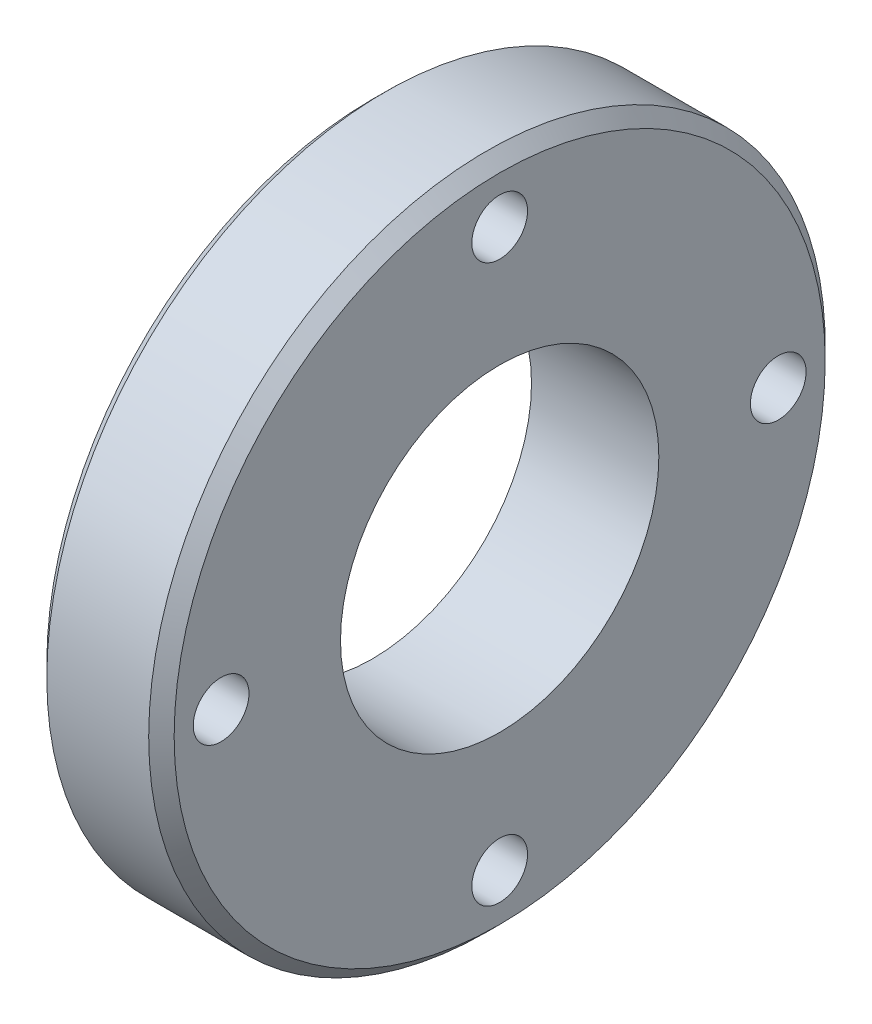
ISO-10303-21;
HEADER;
FILE_DESCRIPTION(('STEP AP214'),'2;1');
FILE_NAME('part.step','',(''),(''),'','','');
FILE_SCHEMA(('AUTOMOTIVE_DESIGN { 1 0 10303 214 1 1 1 1 }'));
ENDSEC;
DATA;
#1=APPLICATION_CONTEXT('core data for automotive mechanical design processes');
#2=APPLICATION_PROTOCOL_DEFINITION('international standard','automotive_design',2000,#1);
#3=PRODUCT_CONTEXT('',#1,'mechanical');
#4=PRODUCT('Part','Part','',(#3));
#5=PRODUCT_RELATED_PRODUCT_CATEGORY('part','',(#4));
#6=PRODUCT_DEFINITION_FORMATION('','',#4);
#7=PRODUCT_DEFINITION_CONTEXT('part definition',#1,'design');
#8=PRODUCT_DEFINITION('design','',#6,#7);
#9=PRODUCT_DEFINITION_SHAPE('','',#8);
#10=(LENGTH_UNIT() NAMED_UNIT(*) SI_UNIT(.MILLI.,.METRE.));
#11=(NAMED_UNIT(*) PLANE_ANGLE_UNIT() SI_UNIT($,.RADIAN.));
#12=(NAMED_UNIT(*) SI_UNIT($,.STERADIAN.) SOLID_ANGLE_UNIT());
#13=UNCERTAINTY_MEASURE_WITH_UNIT(LENGTH_MEASURE(1.E-05),#10,'distance_accuracy_value','');
#14=(GEOMETRIC_REPRESENTATION_CONTEXT(3) GLOBAL_UNCERTAINTY_ASSIGNED_CONTEXT((#13)) GLOBAL_UNIT_ASSIGNED_CONTEXT((#10,
#11,#12)) REPRESENTATION_CONTEXT('',''));
#15=CARTESIAN_POINT('',(0.,0.,0.));
#16=DIRECTION('',(0.,0.,1.));
#17=DIRECTION('',(1.,0.,0.));
#18=AXIS2_PLACEMENT_3D('',#15,#16,#17);
#19=CARTESIAN_POINT('',(14.4,0.,0.));
#20=DIRECTION('',(-1.,0.,0.));
#21=DIRECTION('',(0.,-1.,0.));
#22=AXIS2_PLACEMENT_3D('',#19,#20,#21);
#23=CONICAL_SURFACE('',#22,42.5,0.78539816339745);
#24=CARTESIAN_POINT('',(14.4,0.,0.));
#25=DIRECTION('',(-1.,0.,0.));
#26=DIRECTION('',(0.,0.,1.));
#27=AXIS2_PLACEMENT_3D('',#24,#25,#26);
#28=CIRCLE('',#27,42.5);
#29=CARTESIAN_POINT('',(14.4,0.,42.5));
#30=VERTEX_POINT('',#29);
#31=EDGE_CURVE('E29',#30,#30,#28,.T.);
#32=ORIENTED_EDGE('',*,*,#31,.F.);
#33=EDGE_LOOP('',(#32));
#34=FACE_BOUND('',#33,.T.);
#35=CARTESIAN_POINT('',(16.,0.,0.));
#36=DIRECTION('',(-1.,0.,0.));
#37=DIRECTION('',(0.,-1.,0.));
#38=AXIS2_PLACEMENT_3D('',#35,#36,#37);
#39=CIRCLE('',#38,40.9);
#40=CARTESIAN_POINT('',(16.,-40.9,0.));
#41=VERTEX_POINT('',#40);
#42=EDGE_CURVE('E17',#41,#41,#39,.F.);
#43=ORIENTED_EDGE('',*,*,#42,.F.);
#44=EDGE_LOOP('',(#43));
#45=FACE_BOUND('',#44,.T.);
#46=ADVANCED_FACE('F14',(#34,#45),#23,.T.);
#47=CARTESIAN_POINT('',(16.,0.,0.));
#48=DIRECTION('',(-1.,0.,0.));
#49=DIRECTION('',(0.,0.,1.));
#50=AXIS2_PLACEMENT_3D('',#47,#48,#49);
#51=CYLINDRICAL_SURFACE('',#50,42.5);
#52=ORIENTED_EDGE('',*,*,#31,.T.);
#53=EDGE_LOOP('',(#52));
#54=FACE_BOUND('',#53,.T.);
#55=CARTESIAN_POINT('',(1.6,0.,0.));
#56=DIRECTION('',(1.,0.,0.));
#57=DIRECTION('',(0.,0.,-1.));
#58=AXIS2_PLACEMENT_3D('',#55,#56,#57);
#59=CIRCLE('',#58,42.5);
#60=CARTESIAN_POINT('',(1.60000000000001,0.,-42.5));
#61=VERTEX_POINT('',#60);
#62=EDGE_CURVE('E46',#61,#61,#59,.F.);
#63=ORIENTED_EDGE('',*,*,#62,.F.);
#64=EDGE_LOOP('',(#63));
#65=FACE_BOUND('',#64,.T.);
#66=ADVANCED_FACE('F65',(#54,#65),#51,.T.);
#67=CARTESIAN_POINT('',(16.,0.,0.));
#68=DIRECTION('',(1.,0.,0.));
#69=DIRECTION('',(0.,0.,-1.));
#70=AXIS2_PLACEMENT_3D('',#67,#68,#69);
#71=PLANE('',#70);
#72=CARTESIAN_POINT('',(16.,0.,0.));
#73=DIRECTION('',(-1.,0.,0.));
#74=DIRECTION('',(0.,0.,1.));
#75=AXIS2_PLACEMENT_3D('',#72,#73,#74);
#76=CIRCLE('',#75,20.);
#77=CARTESIAN_POINT('',(16.,0.,20.));
#78=VERTEX_POINT('',#77);
#79=EDGE_CURVE('E43',#78,#78,#76,.T.);
#80=ORIENTED_EDGE('',*,*,#79,.T.);
#81=EDGE_LOOP('',(#80));
#82=FACE_BOUND('',#81,.T.);
#83=ORIENTED_EDGE('',*,*,#42,.T.);
#84=EDGE_LOOP('',(#83));
#85=FACE_BOUND('',#84,.T.);
#86=CARTESIAN_POINT('',(16.,35.,0.));
#87=DIRECTION('',(1.,0.,0.));
#88=DIRECTION('',(0.,0.,-1.));
#89=AXIS2_PLACEMENT_3D('',#86,#87,#88);
#90=CIRCLE('',#89,3.5);
#91=CARTESIAN_POINT('',(16.,35.,-3.5));
#92=VERTEX_POINT('',#91);
#93=EDGE_CURVE('E47',#92,#92,#90,.F.);
#94=ORIENTED_EDGE('',*,*,#93,.T.);
#95=EDGE_LOOP('',(#94));
#96=FACE_BOUND('',#95,.T.);
#97=CARTESIAN_POINT('',(16.,0.,-35.));
#98=DIRECTION('',(1.,0.,0.));
#99=DIRECTION('',(0.,0.,-1.));
#100=AXIS2_PLACEMENT_3D('',#97,#98,#99);
#101=CIRCLE('',#100,3.5);
#102=CARTESIAN_POINT('',(16.,0.,-38.5));
#103=VERTEX_POINT('',#102);
#104=EDGE_CURVE('E50',#103,#103,#101,.F.);
#105=ORIENTED_EDGE('',*,*,#104,.T.);
#106=EDGE_LOOP('',(#105));
#107=FACE_BOUND('',#106,.T.);
#108=CARTESIAN_POINT('',(16.,-35.,0.));
#109=DIRECTION('',(1.,0.,0.));
#110=DIRECTION('',(0.,0.,-1.));
#111=AXIS2_PLACEMENT_3D('',#108,#109,#110);
#112=CIRCLE('',#111,3.5);
#113=CARTESIAN_POINT('',(16.,-35.,-3.5));
#114=VERTEX_POINT('',#113);
#115=EDGE_CURVE('E53',#114,#114,#112,.F.);
#116=ORIENTED_EDGE('',*,*,#115,.T.);
#117=EDGE_LOOP('',(#116));
#118=FACE_BOUND('',#117,.T.);
#119=CARTESIAN_POINT('',(16.,0.,35.));
#120=DIRECTION('',(1.,0.,0.));
#121=DIRECTION('',(0.,0.,-1.));
#122=AXIS2_PLACEMENT_3D('',#119,#120,#121);
#123=CIRCLE('',#122,3.5);
#124=CARTESIAN_POINT('',(16.,0.,31.5));
#125=VERTEX_POINT('',#124);
#126=EDGE_CURVE('E55',#125,#125,#123,.F.);
#127=ORIENTED_EDGE('',*,*,#126,.T.);
#128=EDGE_LOOP('',(#127));
#129=FACE_BOUND('',#128,.T.);
#130=ADVANCED_FACE('F74',(#82,#85,#96,#107,#118,#129),#71,.T.);
#131=CARTESIAN_POINT('',(0.,0.,35.));
#132=DIRECTION('',(1.,0.,0.));
#133=DIRECTION('',(0.,0.,-1.));
#134=AXIS2_PLACEMENT_3D('',#131,#132,#133);
#135=CYLINDRICAL_SURFACE('',#134,3.5);
#136=CARTESIAN_POINT('',(0.,0.,35.));
#137=DIRECTION('',(1.,0.,0.));
#138=DIRECTION('',(0.,0.,-1.));
#139=AXIS2_PLACEMENT_3D('',#136,#137,#138);
#140=CIRCLE('',#139,3.5);
#141=CARTESIAN_POINT('',(0.,0.,31.5));
#142=VERTEX_POINT('',#141);
#143=EDGE_CURVE('E40',#142,#142,#140,.F.);
#144=ORIENTED_EDGE('',*,*,#143,.T.);
#145=EDGE_LOOP('',(#144));
#146=FACE_BOUND('',#145,.T.);
#147=ORIENTED_EDGE('',*,*,#126,.F.);
#148=EDGE_LOOP('',(#147));
#149=FACE_BOUND('',#148,.T.);
#150=ADVANCED_FACE('F101',(#146,#149),#135,.F.);
#151=CARTESIAN_POINT('',(0.,-35.,0.));
#152=DIRECTION('',(1.,0.,0.));
#153=DIRECTION('',(0.,0.,-1.));
#154=AXIS2_PLACEMENT_3D('',#151,#152,#153);
#155=CYLINDRICAL_SURFACE('',#154,3.5);
#156=CARTESIAN_POINT('',(0.,-35.,0.));
#157=DIRECTION('',(1.,0.,0.));
#158=DIRECTION('',(0.,0.,-1.));
#159=AXIS2_PLACEMENT_3D('',#156,#157,#158);
#160=CIRCLE('',#159,3.5);
#161=CARTESIAN_POINT('',(0.,-35.,-3.5));
#162=VERTEX_POINT('',#161);
#163=EDGE_CURVE('E37',#162,#162,#160,.F.);
#164=ORIENTED_EDGE('',*,*,#163,.T.);
#165=EDGE_LOOP('',(#164));
#166=FACE_BOUND('',#165,.T.);
#167=ORIENTED_EDGE('',*,*,#115,.F.);
#168=EDGE_LOOP('',(#167));
#169=FACE_BOUND('',#168,.T.);
#170=ADVANCED_FACE('F97',(#166,#169),#155,.F.);
#171=CARTESIAN_POINT('',(0.,0.,-35.));
#172=DIRECTION('',(1.,0.,0.));
#173=DIRECTION('',(0.,0.,-1.));
#174=AXIS2_PLACEMENT_3D('',#171,#172,#173);
#175=CYLINDRICAL_SURFACE('',#174,3.5);
#176=CARTESIAN_POINT('',(0.,0.,-35.));
#177=DIRECTION('',(1.,0.,0.));
#178=DIRECTION('',(0.,0.,-1.));
#179=AXIS2_PLACEMENT_3D('',#176,#177,#178);
#180=CIRCLE('',#179,3.5);
#181=CARTESIAN_POINT('',(0.,0.,-38.5));
#182=VERTEX_POINT('',#181);
#183=EDGE_CURVE('E34',#182,#182,#180,.F.);
#184=ORIENTED_EDGE('',*,*,#183,.T.);
#185=EDGE_LOOP('',(#184));
#186=FACE_BOUND('',#185,.T.);
#187=ORIENTED_EDGE('',*,*,#104,.F.);
#188=EDGE_LOOP('',(#187));
#189=FACE_BOUND('',#188,.T.);
#190=ADVANCED_FACE('F93',(#186,#189),#175,.F.);
#191=CARTESIAN_POINT('',(0.,35.,0.));
#192=DIRECTION('',(1.,0.,0.));
#193=DIRECTION('',(0.,0.,-1.));
#194=AXIS2_PLACEMENT_3D('',#191,#192,#193);
#195=CYLINDRICAL_SURFACE('',#194,3.5);
#196=CARTESIAN_POINT('',(0.,35.,0.));
#197=DIRECTION('',(1.,0.,0.));
#198=DIRECTION('',(0.,0.,-1.));
#199=AXIS2_PLACEMENT_3D('',#196,#197,#198);
#200=CIRCLE('',#199,3.5);
#201=CARTESIAN_POINT('',(0.,35.,-3.5));
#202=VERTEX_POINT('',#201);
#203=EDGE_CURVE('E26',#202,#202,#200,.F.);
#204=ORIENTED_EDGE('',*,*,#203,.T.);
#205=EDGE_LOOP('',(#204));
#206=FACE_BOUND('',#205,.T.);
#207=ORIENTED_EDGE('',*,*,#93,.F.);
#208=EDGE_LOOP('',(#207));
#209=FACE_BOUND('',#208,.T.);
#210=ADVANCED_FACE('F89',(#206,#209),#195,.F.);
#211=CARTESIAN_POINT('',(1.6,0.,0.));
#212=DIRECTION('',(1.,0.,0.));
#213=DIRECTION('',(0.,0.,-1.));
#214=AXIS2_PLACEMENT_3D('',#211,#212,#213);
#215=CONICAL_SURFACE('',#214,42.5,0.78539816339745);
#216=CARTESIAN_POINT('',(0.,0.,0.));
#217=DIRECTION('',(1.,0.,0.));
#218=DIRECTION('',(0.,0.,-1.));
#219=AXIS2_PLACEMENT_3D('',#216,#217,#218);
#220=CIRCLE('',#219,40.9);
#221=CARTESIAN_POINT('',(0.,0.,-40.9));
#222=VERTEX_POINT('',#221);
#223=EDGE_CURVE('E21',#222,#222,#220,.T.);
#224=ORIENTED_EDGE('',*,*,#223,.T.);
#225=EDGE_LOOP('',(#224));
#226=FACE_BOUND('',#225,.T.);
#227=ORIENTED_EDGE('',*,*,#62,.T.);
#228=EDGE_LOOP('',(#227));
#229=FACE_BOUND('',#228,.T.);
#230=ADVANCED_FACE('F83',(#226,#229),#215,.T.);
#231=CARTESIAN_POINT('',(16.,0.,0.));
#232=DIRECTION('',(-1.,0.,0.));
#233=DIRECTION('',(0.,0.,1.));
#234=AXIS2_PLACEMENT_3D('',#231,#232,#233);
#235=CYLINDRICAL_SURFACE('',#234,20.);
#236=CARTESIAN_POINT('',(0.,0.,0.));
#237=DIRECTION('',(-1.,0.,0.));
#238=DIRECTION('',(0.,0.,1.));
#239=AXIS2_PLACEMENT_3D('',#236,#237,#238);
#240=CIRCLE('',#239,20.);
#241=CARTESIAN_POINT('',(0.,0.,20.));
#242=VERTEX_POINT('',#241);
#243=EDGE_CURVE('E10',#242,#242,#240,.T.);
#244=ORIENTED_EDGE('',*,*,#243,.T.);
#245=EDGE_LOOP('',(#244));
#246=FACE_BOUND('',#245,.T.);
#247=ORIENTED_EDGE('',*,*,#79,.F.);
#248=EDGE_LOOP('',(#247));
#249=FACE_BOUND('',#248,.T.);
#250=ADVANCED_FACE('F77',(#246,#249),#235,.F.);
#251=CARTESIAN_POINT('',(0.,0.,0.));
#252=DIRECTION('',(1.,0.,0.));
#253=DIRECTION('',(0.,0.,-1.));
#254=AXIS2_PLACEMENT_3D('',#251,#252,#253);
#255=PLANE('',#254);
#256=ORIENTED_EDGE('',*,*,#243,.F.);
#257=EDGE_LOOP('',(#256));
#258=FACE_BOUND('',#257,.T.);
#259=ORIENTED_EDGE('',*,*,#223,.F.);
#260=EDGE_LOOP('',(#259));
#261=FACE_BOUND('',#260,.T.);
#262=ORIENTED_EDGE('',*,*,#203,.F.);
#263=EDGE_LOOP('',(#262));
#264=FACE_BOUND('',#263,.T.);
#265=ORIENTED_EDGE('',*,*,#183,.F.);
#266=EDGE_LOOP('',(#265));
#267=FACE_BOUND('',#266,.T.);
#268=ORIENTED_EDGE('',*,*,#163,.F.);
#269=EDGE_LOOP('',(#268));
#270=FACE_BOUND('',#269,.T.);
#271=ORIENTED_EDGE('',*,*,#143,.F.);
#272=EDGE_LOOP('',(#271));
#273=FACE_BOUND('',#272,.T.);
#274=ADVANCED_FACE('F75',(#258,#261,#264,#267,#270,#273),#255,.F.);
#275=CLOSED_SHELL('',(#46,#66,#130,#150,#170,#190,#210,#230,#250,#274));
#276=MANIFOLD_SOLID_BREP('B1',#275);
#277=ADVANCED_BREP_SHAPE_REPRESENTATION('',(#18,#276),#14);
#278=SHAPE_DEFINITION_REPRESENTATION(#9,#277);
ENDSEC;
END-ISO-10303-21;
